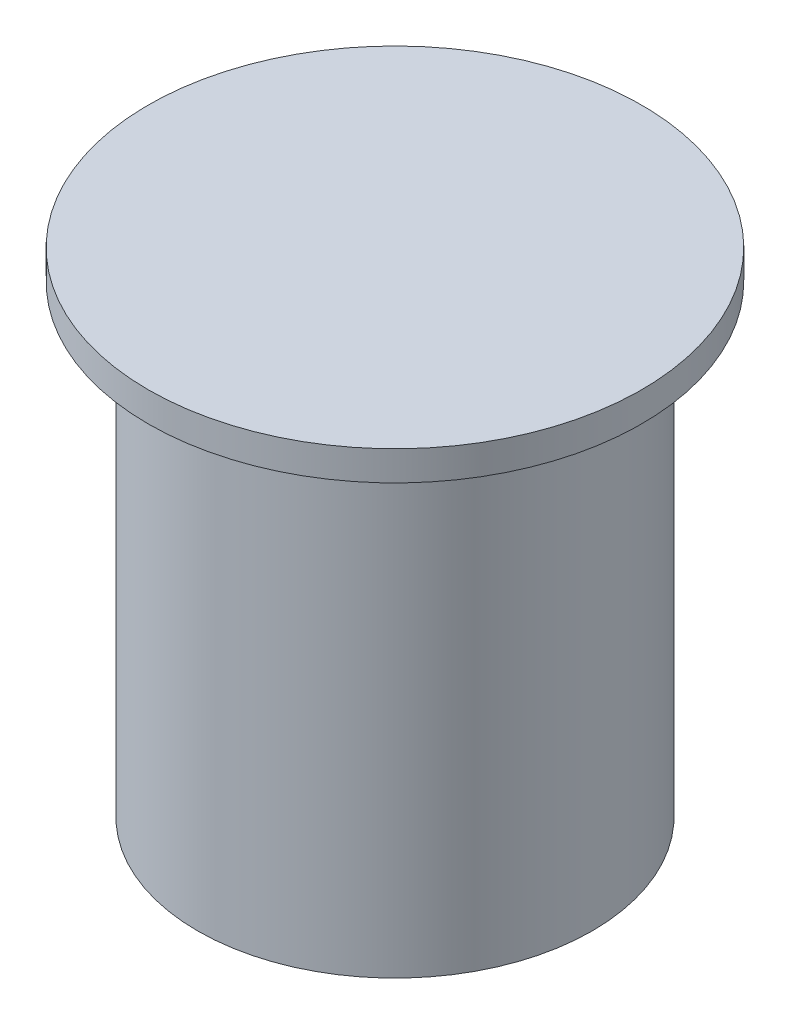
ISO-10303-21;
HEADER;
FILE_DESCRIPTION(('STEP AP214'),'2;1');
FILE_NAME('part.step','',(''),(''),'','','');
FILE_SCHEMA(('AUTOMOTIVE_DESIGN { 1 0 10303 214 1 1 1 1 }'));
ENDSEC;
DATA;
#1=APPLICATION_CONTEXT('core data for automotive mechanical design processes');
#2=APPLICATION_PROTOCOL_DEFINITION('international standard','automotive_design',2000,#1);
#3=PRODUCT_CONTEXT('',#1,'mechanical');
#4=PRODUCT('Part','Part','',(#3));
#5=PRODUCT_RELATED_PRODUCT_CATEGORY('part','',(#4));
#6=PRODUCT_DEFINITION_FORMATION('','',#4);
#7=PRODUCT_DEFINITION_CONTEXT('part definition',#1,'design');
#8=PRODUCT_DEFINITION('design','',#6,#7);
#9=PRODUCT_DEFINITION_SHAPE('','',#8);
#10=(LENGTH_UNIT() NAMED_UNIT(*) SI_UNIT(.MILLI.,.METRE.));
#11=(NAMED_UNIT(*) PLANE_ANGLE_UNIT() SI_UNIT($,.RADIAN.));
#12=(NAMED_UNIT(*) SI_UNIT($,.STERADIAN.) SOLID_ANGLE_UNIT());
#13=UNCERTAINTY_MEASURE_WITH_UNIT(LENGTH_MEASURE(1.E-05),#10,'distance_accuracy_value','');
#14=(GEOMETRIC_REPRESENTATION_CONTEXT(3) GLOBAL_UNCERTAINTY_ASSIGNED_CONTEXT((#13)) GLOBAL_UNIT_ASSIGNED_CONTEXT((#10,
#11,#12)) REPRESENTATION_CONTEXT('',''));
#15=CARTESIAN_POINT('',(0.,0.,0.));
#16=DIRECTION('',(0.,0.,1.));
#17=DIRECTION('',(1.,0.,0.));
#18=AXIS2_PLACEMENT_3D('',#15,#16,#17);
#19=CARTESIAN_POINT('',(0.,188.,0.));
#20=DIRECTION('',(0.,-1.,0.));
#21=DIRECTION('',(0.,0.,-1.));
#22=AXIS2_PLACEMENT_3D('',#19,#20,#21);
#23=CYLINDRICAL_SURFACE('',#22,80.);
#24=CARTESIAN_POINT('',(0.,188.,0.));
#25=DIRECTION('',(0.,1.,0.));
#26=DIRECTION('',(0.,0.,1.));
#27=AXIS2_PLACEMENT_3D('',#24,#25,#26);
#28=CIRCLE('',#27,80.);
#29=CARTESIAN_POINT('',(0.,188.,80.));
#30=VERTEX_POINT('',#29);
#31=EDGE_CURVE('E10',#30,#30,#28,.T.);
#32=ORIENTED_EDGE('',*,*,#31,.F.);
#33=EDGE_LOOP('',(#32));
#34=FACE_BOUND('',#33,.T.);
#35=CARTESIAN_POINT('',(0.,0.,0.));
#36=DIRECTION('',(0.,1.,0.));
#37=DIRECTION('',(0.,0.,1.));
#38=AXIS2_PLACEMENT_3D('',#35,#36,#37);
#39=CIRCLE('',#38,80.);
#40=CARTESIAN_POINT('',(0.,0.,80.));
#41=VERTEX_POINT('',#40);
#42=EDGE_CURVE('E37',#41,#41,#39,.T.);
#43=ORIENTED_EDGE('',*,*,#42,.T.);
#44=EDGE_LOOP('',(#43));
#45=FACE_BOUND('',#44,.T.);
#46=ADVANCED_FACE('F34',(#34,#45),#23,.T.);
#47=CARTESIAN_POINT('',(0.,0.,0.));
#48=DIRECTION('',(0.,1.,0.));
#49=DIRECTION('',(0.,0.,1.));
#50=AXIS2_PLACEMENT_3D('',#47,#48,#49);
#51=PLANE('',#50);
#52=ORIENTED_EDGE('',*,*,#42,.F.);
#53=EDGE_LOOP('',(#52));
#54=FACE_BOUND('',#53,.T.);
#55=ADVANCED_FACE('F62',(#54),#51,.F.);
#56=CARTESIAN_POINT('',(0.,188.,0.));
#57=DIRECTION('',(0.,1.,0.));
#58=DIRECTION('',(0.,0.,1.));
#59=AXIS2_PLACEMENT_3D('',#56,#57,#58);
#60=PLANE('',#59);
#61=CARTESIAN_POINT('',(0.,188.,0.));
#62=DIRECTION('',(0.,1.,0.));
#63=DIRECTION('',(0.,0.,1.));
#64=AXIS2_PLACEMENT_3D('',#61,#62,#63);
#65=CIRCLE('',#64,100.);
#66=CARTESIAN_POINT('',(0.,188.,100.));
#67=VERTEX_POINT('',#66);
#68=EDGE_CURVE('E46',#67,#67,#65,.T.);
#69=ORIENTED_EDGE('',*,*,#68,.F.);
#70=EDGE_LOOP('',(#69));
#71=FACE_BOUND('',#70,.T.);
#72=ORIENTED_EDGE('',*,*,#31,.T.);
#73=EDGE_LOOP('',(#72));
#74=FACE_BOUND('',#73,.T.);
#75=ADVANCED_FACE('F57',(#71,#74),#60,.F.);
#76=CARTESIAN_POINT('',(0.,200.,0.));
#77=DIRECTION('',(0.,-1.,0.));
#78=DIRECTION('',(0.,0.,-1.));
#79=AXIS2_PLACEMENT_3D('',#76,#77,#78);
#80=CYLINDRICAL_SURFACE('',#79,100.);
#81=CARTESIAN_POINT('',(0.,200.,0.));
#82=DIRECTION('',(0.,1.,0.));
#83=DIRECTION('',(0.,0.,1.));
#84=AXIS2_PLACEMENT_3D('',#81,#82,#83);
#85=CIRCLE('',#84,100.);
#86=CARTESIAN_POINT('',(0.,200.,100.));
#87=VERTEX_POINT('',#86);
#88=EDGE_CURVE('E44',#87,#87,#85,.T.);
#89=ORIENTED_EDGE('',*,*,#88,.F.);
#90=EDGE_LOOP('',(#89));
#91=FACE_BOUND('',#90,.T.);
#92=ORIENTED_EDGE('',*,*,#68,.T.);
#93=EDGE_LOOP('',(#92));
#94=FACE_BOUND('',#93,.T.);
#95=ADVANCED_FACE('F54',(#91,#94),#80,.T.);
#96=CARTESIAN_POINT('',(0.,200.,0.));
#97=DIRECTION('',(0.,1.,0.));
#98=DIRECTION('',(0.,0.,1.));
#99=AXIS2_PLACEMENT_3D('',#96,#97,#98);
#100=PLANE('',#99);
#101=ORIENTED_EDGE('',*,*,#88,.T.);
#102=EDGE_LOOP('',(#101));
#103=FACE_BOUND('',#102,.T.);
#104=ADVANCED_FACE('F52',(#103),#100,.T.);
#105=CLOSED_SHELL('',(#46,#55,#75,#95,#104));
#106=MANIFOLD_SOLID_BREP('B2',#105);
#107=ADVANCED_BREP_SHAPE_REPRESENTATION('',(#18,#106),#14);
#108=SHAPE_DEFINITION_REPRESENTATION(#9,#107);
ENDSEC;
END-ISO-10303-21;
